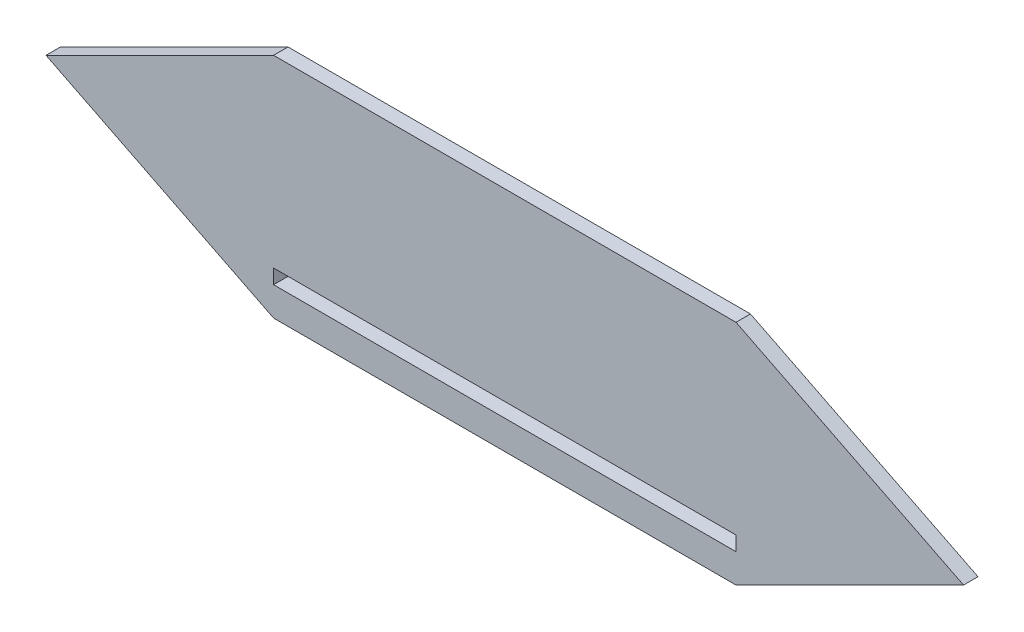
ISO-10303-21;
HEADER;
FILE_DESCRIPTION(('STEP AP214'),'2;1');
FILE_NAME('part.step','',(''),(''),'','','');
FILE_SCHEMA(('AUTOMOTIVE_DESIGN { 1 0 10303 214 1 1 1 1 }'));
ENDSEC;
DATA;
#1=APPLICATION_CONTEXT('core data for automotive mechanical design processes');
#2=APPLICATION_PROTOCOL_DEFINITION('international standard','automotive_design',2000,#1);
#3=PRODUCT_CONTEXT('',#1,'mechanical');
#4=PRODUCT('Part','Part','',(#3));
#5=PRODUCT_RELATED_PRODUCT_CATEGORY('part','',(#4));
#6=PRODUCT_DEFINITION_FORMATION('','',#4);
#7=PRODUCT_DEFINITION_CONTEXT('part definition',#1,'design');
#8=PRODUCT_DEFINITION('design','',#6,#7);
#9=PRODUCT_DEFINITION_SHAPE('','',#8);
#10=(LENGTH_UNIT() NAMED_UNIT(*) SI_UNIT(.MILLI.,.METRE.));
#11=(NAMED_UNIT(*) PLANE_ANGLE_UNIT() SI_UNIT($,.RADIAN.));
#12=(NAMED_UNIT(*) SI_UNIT($,.STERADIAN.) SOLID_ANGLE_UNIT());
#13=UNCERTAINTY_MEASURE_WITH_UNIT(LENGTH_MEASURE(1.E-05),#10,'distance_accuracy_value','');
#14=(GEOMETRIC_REPRESENTATION_CONTEXT(3) GLOBAL_UNCERTAINTY_ASSIGNED_CONTEXT((#13)) GLOBAL_UNIT_ASSIGNED_CONTEXT((#10,
#11,#12)) REPRESENTATION_CONTEXT('',''));
#15=CARTESIAN_POINT('',(0.,0.,0.));
#16=DIRECTION('',(0.,0.,1.));
#17=DIRECTION('',(1.,0.,0.));
#18=AXIS2_PLACEMENT_3D('',#15,#16,#17);
#19=CARTESIAN_POINT('',(0.,0.,0.));
#20=DIRECTION('',(0.,0.,1.));
#21=DIRECTION('',(1.,0.,0.));
#22=AXIS2_PLACEMENT_3D('',#19,#20,#21);
#23=PLANE('',#22);
#24=DIRECTION('',(-0.894427190999916,-0.447213595499958,0.));
#25=VECTOR('',#24,1.);
#26=CARTESIAN_POINT('',(-40.,80.,0.));
#27=LINE('',#26,#25);
#28=CARTESIAN_POINT('',(0.,100.,0.));
#29=VERTEX_POINT('',#28);
#30=CARTESIAN_POINT('',(-100.,50.,0.));
#31=VERTEX_POINT('',#30);
#32=EDGE_CURVE('E339',#29,#31,#27,.T.);
#33=ORIENTED_EDGE('',*,*,#32,.F.);
#34=DIRECTION('',(1.,0.,0.));
#35=VECTOR('',#34,1.);
#36=CARTESIAN_POINT('',(0.,100.,0.));
#37=LINE('',#36,#35);
#38=CARTESIAN_POINT('',(203.2,100.,0.));
#39=VERTEX_POINT('',#38);
#40=EDGE_CURVE('E344',#29,#39,#37,.T.);
#41=ORIENTED_EDGE('',*,*,#40,.T.);
#42=DIRECTION('',(0.894427190999916,-0.447213595499958,0.));
#43=VECTOR('',#42,1.);
#44=CARTESIAN_POINT('',(80.64,161.28,0.));
#45=LINE('',#44,#43);
#46=CARTESIAN_POINT('',(303.2,50.,0.));
#47=VERTEX_POINT('',#46);
#48=EDGE_CURVE('E368',#39,#47,#45,.T.);
#49=ORIENTED_EDGE('',*,*,#48,.T.);
#50=DIRECTION('',(-0.894427190999916,-0.447213595499958,0.));
#51=VECTOR('',#50,1.);
#52=CARTESIAN_POINT('',(40.64,-81.28,0.));
#53=LINE('',#52,#51);
#54=CARTESIAN_POINT('',(203.2,0.,0.));
#55=VERTEX_POINT('',#54);
#56=EDGE_CURVE('E365',#47,#55,#53,.T.);
#57=ORIENTED_EDGE('',*,*,#56,.T.);
#58=DIRECTION('',(1.,0.,0.));
#59=VECTOR('',#58,1.);
#60=CARTESIAN_POINT('',(0.,0.,0.));
#61=LINE('',#60,#59);
#62=CARTESIAN_POINT('',(0.,0.,0.));
#63=VERTEX_POINT('',#62);
#64=EDGE_CURVE('E362',#63,#55,#61,.T.);
#65=ORIENTED_EDGE('',*,*,#64,.F.);
#66=DIRECTION('',(0.894427190999916,-0.447213595499958,0.));
#67=VECTOR('',#66,1.);
#68=CARTESIAN_POINT('',(0.,0.,0.));
#69=LINE('',#68,#67);
#70=EDGE_CURVE('E360',#31,#63,#69,.T.);
#71=ORIENTED_EDGE('',*,*,#70,.F.);
#72=EDGE_LOOP('',(#33,#41,#49,#57,#65,#71));
#73=FACE_BOUND('',#72,.T.);
#74=DIRECTION('',(0.,1.,0.));
#75=VECTOR('',#74,1.);
#76=CARTESIAN_POINT('',(177.8,0.,0.));
#77=LINE('',#76,#75);
#78=CARTESIAN_POINT('',(177.8,19.05,0.));
#79=VERTEX_POINT('',#78);
#80=CARTESIAN_POINT('',(177.8,25.05,0.));
#81=VERTEX_POINT('',#80);
#82=EDGE_CURVE('E251',#79,#81,#77,.T.);
#83=ORIENTED_EDGE('',*,*,#82,.F.);
#84=DIRECTION('',(1.,0.,0.));
#85=VECTOR('',#84,1.);
#86=CARTESIAN_POINT('',(203.2,19.05,0.));
#87=LINE('',#86,#85);
#88=CARTESIAN_POINT('',(25.4,19.05,0.));
#89=VERTEX_POINT('',#88);
#90=EDGE_CURVE('E231',#89,#79,#87,.T.);
#91=ORIENTED_EDGE('',*,*,#90,.F.);
#92=DIRECTION('',(0.,1.,0.));
#93=VECTOR('',#92,1.);
#94=CARTESIAN_POINT('',(25.4,0.,0.));
#95=LINE('',#94,#93);
#96=CARTESIAN_POINT('',(25.4,25.05,0.));
#97=VERTEX_POINT('',#96);
#98=EDGE_CURVE('E296',#89,#97,#95,.T.);
#99=ORIENTED_EDGE('',*,*,#98,.T.);
#100=DIRECTION('',(1.,0.,0.));
#101=VECTOR('',#100,1.);
#102=CARTESIAN_POINT('',(0.,25.05,0.));
#103=LINE('',#102,#101);
#104=CARTESIAN_POINT('',(-6.00000000000001,25.05,0.));
#105=VERTEX_POINT('',#104);
#106=EDGE_CURVE('E91',#105,#97,#103,.T.);
#107=ORIENTED_EDGE('',*,*,#106,.F.);
#108=DIRECTION('',(0.,-1.,0.));
#109=VECTOR('',#108,1.);
#110=CARTESIAN_POINT('',(-6.00000000000001,0.,0.));
#111=LINE('',#110,#109);
#112=CARTESIAN_POINT('',(-6.00000000000001,6.69999999999998,0.));
#113=VERTEX_POINT('',#112);
#114=EDGE_CURVE('E318',#105,#113,#111,.T.);
#115=ORIENTED_EDGE('',*,*,#114,.T.);
#116=DIRECTION('',(-1.,0.,0.));
#117=VECTOR('',#116,1.);
#118=CARTESIAN_POINT('',(0.,6.69999999999998,0.));
#119=LINE('',#118,#117);
#120=CARTESIAN_POINT('',(25.4,6.69999999999998,0.));
#121=VERTEX_POINT('',#120);
#122=EDGE_CURVE('E315',#121,#113,#119,.T.);
#123=ORIENTED_EDGE('',*,*,#122,.F.);
#124=DIRECTION('',(0.,1.,0.));
#125=VECTOR('',#124,1.);
#126=CARTESIAN_POINT('',(25.4,0.,0.));
#127=LINE('',#126,#125);
#128=CARTESIAN_POINT('',(25.4,12.7,0.));
#129=VERTEX_POINT('',#128);
#130=EDGE_CURVE('E227',#121,#129,#127,.T.);
#131=ORIENTED_EDGE('',*,*,#130,.T.);
#132=DIRECTION('',(-1.,0.,0.));
#133=VECTOR('',#132,1.);
#134=CARTESIAN_POINT('',(203.2,12.7,0.));
#135=LINE('',#134,#133);
#136=CARTESIAN_POINT('',(177.8,12.7,0.));
#137=VERTEX_POINT('',#136);
#138=EDGE_CURVE('E220',#137,#129,#135,.T.);
#139=ORIENTED_EDGE('',*,*,#138,.F.);
#140=DIRECTION('',(0.,1.,0.));
#141=VECTOR('',#140,1.);
#142=CARTESIAN_POINT('',(177.8,6.69999999999998,0.));
#143=LINE('',#142,#141);
#144=CARTESIAN_POINT('',(177.8,6.69999999999998,0.));
#145=VERTEX_POINT('',#144);
#146=EDGE_CURVE('E224',#145,#137,#143,.T.);
#147=ORIENTED_EDGE('',*,*,#146,.F.);
#148=DIRECTION('',(-1.,0.,0.));
#149=VECTOR('',#148,1.);
#150=CARTESIAN_POINT('',(203.2,6.69999999999998,0.));
#151=LINE('',#150,#149);
#152=CARTESIAN_POINT('',(209.2,6.69999999999998,0.));
#153=VERTEX_POINT('',#152);
#154=EDGE_CURVE('E242',#153,#145,#151,.T.);
#155=ORIENTED_EDGE('',*,*,#154,.F.);
#156=DIRECTION('',(0.,-1.,0.));
#157=VECTOR('',#156,1.);
#158=CARTESIAN_POINT('',(209.2,0.,0.));
#159=LINE('',#158,#157);
#160=CARTESIAN_POINT('',(209.2,25.05,0.));
#161=VERTEX_POINT('',#160);
#162=EDGE_CURVE('E272',#161,#153,#159,.T.);
#163=ORIENTED_EDGE('',*,*,#162,.F.);
#164=DIRECTION('',(-1.,0.,0.));
#165=VECTOR('',#164,1.);
#166=CARTESIAN_POINT('',(0.,25.05,0.));
#167=LINE('',#166,#165);
#168=EDGE_CURVE('E275',#161,#81,#167,.T.);
#169=ORIENTED_EDGE('',*,*,#168,.T.);
#170=EDGE_LOOP('',(#83,#91,#99,#107,#115,#123,#131,#139,#147,#155,#163,#169));
#171=FACE_BOUND('',#170,.T.);
#172=ADVANCED_FACE('F68',(#73,#171),#23,.F.);
#173=CARTESIAN_POINT('',(-40.,80.,6.35));
#174=DIRECTION('',(0.447213595499958,-0.894427190999916,0.));
#175=DIRECTION('',(0.894427190999916,0.447213595499958,0.));
#176=AXIS2_PLACEMENT_3D('',#173,#174,#175);
#177=PLANE('',#176);
#178=ORIENTED_EDGE('',*,*,#32,.T.);
#179=DIRECTION('',(0.,0.,-1.));
#180=VECTOR('',#179,1.);
#181=CARTESIAN_POINT('',(-100.,50.,6.35));
#182=LINE('',#181,#180);
#183=CARTESIAN_POINT('',(-100.,50.,6.35));
#184=VERTEX_POINT('',#183);
#185=EDGE_CURVE('E383',#184,#31,#182,.T.);
#186=ORIENTED_EDGE('',*,*,#185,.F.);
#187=DIRECTION('',(-0.894427190999916,-0.447213595499958,0.));
#188=VECTOR('',#187,1.);
#189=CARTESIAN_POINT('',(-40.,80.,6.35));
#190=LINE('',#189,#188);
#191=CARTESIAN_POINT('',(0.,100.,6.35));
#192=VERTEX_POINT('',#191);
#193=EDGE_CURVE('E340',#192,#184,#190,.T.);
#194=ORIENTED_EDGE('',*,*,#193,.F.);
#195=DIRECTION('',(0.,0.,-1.));
#196=VECTOR('',#195,1.);
#197=CARTESIAN_POINT('',(0.,100.,6.35));
#198=LINE('',#197,#196);
#199=EDGE_CURVE('E357',#192,#29,#198,.T.);
#200=ORIENTED_EDGE('',*,*,#199,.T.);
#201=EDGE_LOOP('',(#178,#186,#194,#200));
#202=FACE_BOUND('',#201,.T.);
#203=ADVANCED_FACE('F70',(#202),#177,.F.);
#204=CARTESIAN_POINT('',(0.,0.,6.35));
#205=DIRECTION('',(0.447213595499958,0.894427190999916,0.));
#206=DIRECTION('',(-0.894427190999916,0.447213595499958,0.));
#207=AXIS2_PLACEMENT_3D('',#204,#205,#206);
#208=PLANE('',#207);
#209=ORIENTED_EDGE('',*,*,#70,.T.);
#210=DIRECTION('',(0.,0.,-1.));
#211=VECTOR('',#210,1.);
#212=CARTESIAN_POINT('',(0.,0.,6.35));
#213=LINE('',#212,#211);
#214=CARTESIAN_POINT('',(0.,0.,6.35));
#215=VERTEX_POINT('',#214);
#216=EDGE_CURVE('E380',#215,#63,#213,.T.);
#217=ORIENTED_EDGE('',*,*,#216,.F.);
#218=DIRECTION('',(0.894427190999916,-0.447213595499958,0.));
#219=VECTOR('',#218,1.);
#220=CARTESIAN_POINT('',(0.,0.,6.35));
#221=LINE('',#220,#219);
#222=EDGE_CURVE('E343',#184,#215,#221,.T.);
#223=ORIENTED_EDGE('',*,*,#222,.F.);
#224=ORIENTED_EDGE('',*,*,#185,.T.);
#225=EDGE_LOOP('',(#209,#217,#223,#224));
#226=FACE_BOUND('',#225,.T.);
#227=ADVANCED_FACE('F440',(#226),#208,.F.);
#228=CARTESIAN_POINT('',(0.,0.,6.35));
#229=DIRECTION('',(0.,1.,0.));
#230=DIRECTION('',(0.,0.,1.));
#231=AXIS2_PLACEMENT_3D('',#228,#229,#230);
#232=PLANE('',#231);
#233=ORIENTED_EDGE('',*,*,#64,.T.);
#234=DIRECTION('',(0.,0.,-1.));
#235=VECTOR('',#234,1.);
#236=CARTESIAN_POINT('',(203.2,0.,6.35));
#237=LINE('',#236,#235);
#238=CARTESIAN_POINT('',(203.2,0.,6.35));
#239=VERTEX_POINT('',#238);
#240=EDGE_CURVE('E378',#239,#55,#237,.T.);
#241=ORIENTED_EDGE('',*,*,#240,.F.);
#242=DIRECTION('',(1.,0.,0.));
#243=VECTOR('',#242,1.);
#244=CARTESIAN_POINT('',(0.,0.,6.35));
#245=LINE('',#244,#243);
#246=EDGE_CURVE('E346',#215,#239,#245,.T.);
#247=ORIENTED_EDGE('',*,*,#246,.F.);
#248=ORIENTED_EDGE('',*,*,#216,.T.);
#249=EDGE_LOOP('',(#233,#241,#247,#248));
#250=FACE_BOUND('',#249,.T.);
#251=ADVANCED_FACE('F457',(#250),#232,.F.);
#252=CARTESIAN_POINT('',(40.64,-81.28,6.35));
#253=DIRECTION('',(0.447213595499958,-0.894427190999916,0.));
#254=DIRECTION('',(0.894427190999916,0.447213595499958,0.));
#255=AXIS2_PLACEMENT_3D('',#252,#253,#254);
#256=PLANE('',#255);
#257=ORIENTED_EDGE('',*,*,#56,.F.);
#258=DIRECTION('',(0.,0.,-1.));
#259=VECTOR('',#258,1.);
#260=CARTESIAN_POINT('',(303.2,50.,6.35));
#261=LINE('',#260,#259);
#262=CARTESIAN_POINT('',(303.2,50.,6.35));
#263=VERTEX_POINT('',#262);
#264=EDGE_CURVE('E376',#263,#47,#261,.T.);
#265=ORIENTED_EDGE('',*,*,#264,.F.);
#266=DIRECTION('',(-0.894427190999916,-0.447213595499958,0.));
#267=VECTOR('',#266,1.);
#268=CARTESIAN_POINT('',(40.64,-81.28,6.35));
#269=LINE('',#268,#267);
#270=EDGE_CURVE('E348',#263,#239,#269,.T.);
#271=ORIENTED_EDGE('',*,*,#270,.T.);
#272=ORIENTED_EDGE('',*,*,#240,.T.);
#273=EDGE_LOOP('',(#257,#265,#271,#272));
#274=FACE_BOUND('',#273,.T.);
#275=ADVANCED_FACE('F453',(#274),#256,.T.);
#276=CARTESIAN_POINT('',(80.64,161.28,6.35));
#277=DIRECTION('',(0.447213595499958,0.894427190999916,0.));
#278=DIRECTION('',(-0.894427190999916,0.447213595499958,0.));
#279=AXIS2_PLACEMENT_3D('',#276,#277,#278);
#280=PLANE('',#279);
#281=ORIENTED_EDGE('',*,*,#48,.F.);
#282=DIRECTION('',(0.,0.,-1.));
#283=VECTOR('',#282,1.);
#284=CARTESIAN_POINT('',(203.2,100.,6.35));
#285=LINE('',#284,#283);
#286=CARTESIAN_POINT('',(203.2,100.,6.35));
#287=VERTEX_POINT('',#286);
#288=EDGE_CURVE('E374',#287,#39,#285,.T.);
#289=ORIENTED_EDGE('',*,*,#288,.F.);
#290=DIRECTION('',(0.894427190999916,-0.447213595499958,0.));
#291=VECTOR('',#290,1.);
#292=CARTESIAN_POINT('',(80.64,161.28,6.35));
#293=LINE('',#292,#291);
#294=EDGE_CURVE('E351',#287,#263,#293,.T.);
#295=ORIENTED_EDGE('',*,*,#294,.T.);
#296=ORIENTED_EDGE('',*,*,#264,.T.);
#297=EDGE_LOOP('',(#281,#289,#295,#296));
#298=FACE_BOUND('',#297,.T.);
#299=ADVANCED_FACE('F449',(#298),#280,.T.);
#300=CARTESIAN_POINT('',(0.,100.,6.35));
#301=DIRECTION('',(0.,1.,0.));
#302=DIRECTION('',(0.,0.,1.));
#303=AXIS2_PLACEMENT_3D('',#300,#301,#302);
#304=PLANE('',#303);
#305=ORIENTED_EDGE('',*,*,#40,.F.);
#306=ORIENTED_EDGE('',*,*,#199,.F.);
#307=DIRECTION('',(1.,0.,0.));
#308=VECTOR('',#307,1.);
#309=CARTESIAN_POINT('',(0.,100.,6.35));
#310=LINE('',#309,#308);
#311=EDGE_CURVE('E354',#192,#287,#310,.T.);
#312=ORIENTED_EDGE('',*,*,#311,.T.);
#313=ORIENTED_EDGE('',*,*,#288,.T.);
#314=EDGE_LOOP('',(#305,#306,#312,#313));
#315=FACE_BOUND('',#314,.T.);
#316=ADVANCED_FACE('F446',(#315),#304,.T.);
#317=CARTESIAN_POINT('',(0.,0.,6.35));
#318=DIRECTION('',(0.,0.,1.));
#319=DIRECTION('',(1.,0.,0.));
#320=AXIS2_PLACEMENT_3D('',#317,#318,#319);
#321=PLANE('',#320);
#322=DIRECTION('',(0.,1.,0.));
#323=VECTOR('',#322,1.);
#324=CARTESIAN_POINT('',(203.2,0.,6.35));
#325=LINE('',#324,#323);
#326=CARTESIAN_POINT('',(203.2,12.7,6.35));
#327=VERTEX_POINT('',#326);
#328=CARTESIAN_POINT('',(203.2,19.05,6.35));
#329=VERTEX_POINT('',#328);
#330=EDGE_CURVE('E12',#327,#329,#325,.T.);
#331=ORIENTED_EDGE('',*,*,#330,.F.);
#332=DIRECTION('',(1.,0.,0.));
#333=VECTOR('',#332,1.);
#334=CARTESIAN_POINT('',(0.,12.7,6.35));
#335=LINE('',#334,#333);
#336=CARTESIAN_POINT('',(0.,12.7,6.35));
#337=VERTEX_POINT('',#336);
#338=EDGE_CURVE('E386',#337,#327,#335,.T.);
#339=ORIENTED_EDGE('',*,*,#338,.F.);
#340=DIRECTION('',(0.,-1.,0.));
#341=VECTOR('',#340,1.);
#342=CARTESIAN_POINT('',(0.,0.,6.35));
#343=LINE('',#342,#341);
#344=CARTESIAN_POINT('',(0.,19.05,6.35));
#345=VERTEX_POINT('',#344);
#346=EDGE_CURVE('E388',#345,#337,#343,.T.);
#347=ORIENTED_EDGE('',*,*,#346,.F.);
#348=DIRECTION('',(-1.,0.,0.));
#349=VECTOR('',#348,1.);
#350=CARTESIAN_POINT('',(0.,19.05,6.35));
#351=LINE('',#350,#349);
#352=EDGE_CURVE('E76',#329,#345,#351,.T.);
#353=ORIENTED_EDGE('',*,*,#352,.F.);
#354=EDGE_LOOP('',(#331,#339,#347,#353));
#355=FACE_BOUND('',#354,.T.);
#356=ORIENTED_EDGE('',*,*,#193,.T.);
#357=ORIENTED_EDGE('',*,*,#222,.T.);
#358=ORIENTED_EDGE('',*,*,#246,.T.);
#359=ORIENTED_EDGE('',*,*,#270,.F.);
#360=ORIENTED_EDGE('',*,*,#294,.F.);
#361=ORIENTED_EDGE('',*,*,#311,.F.);
#362=EDGE_LOOP('',(#356,#357,#358,#359,#360,#361));
#363=FACE_BOUND('',#362,.T.);
#364=ADVANCED_FACE('F400',(#355,#363),#321,.T.);
#365=CARTESIAN_POINT('',(0.,19.05,-25.));
#366=DIRECTION('',(0.,-1.,0.));
#367=DIRECTION('',(0.,0.,-1.));
#368=AXIS2_PLACEMENT_3D('',#365,#366,#367);
#369=PLANE('',#368);
#370=DIRECTION('',(0.,0.,1.));
#371=VECTOR('',#370,1.);
#372=CARTESIAN_POINT('',(25.4,19.05,-25.));
#373=LINE('',#372,#371);
#374=CARTESIAN_POINT('',(25.4,19.05,-25.));
#375=VERTEX_POINT('',#374);
#376=EDGE_CURVE('E313',#375,#89,#373,.T.);
#377=ORIENTED_EDGE('',*,*,#376,.T.);
#378=ORIENTED_EDGE('',*,*,#90,.T.);
#379=DIRECTION('',(0.,0.,1.));
#380=VECTOR('',#379,1.);
#381=CARTESIAN_POINT('',(177.8,19.05,-25.));
#382=LINE('',#381,#380);
#383=CARTESIAN_POINT('',(177.8,19.05,-25.));
#384=VERTEX_POINT('',#383);
#385=EDGE_CURVE('E257',#384,#79,#382,.T.);
#386=ORIENTED_EDGE('',*,*,#385,.F.);
#387=DIRECTION('',(-1.,0.,0.));
#388=VECTOR('',#387,1.);
#389=CARTESIAN_POINT('',(0.,19.05,-25.));
#390=LINE('',#389,#388);
#391=CARTESIAN_POINT('',(203.2,19.05,-25.));
#392=VERTEX_POINT('',#391);
#393=EDGE_CURVE('E276',#392,#384,#390,.T.);
#394=ORIENTED_EDGE('',*,*,#393,.F.);
#395=DIRECTION('',(0.,0.,1.));
#396=VECTOR('',#395,1.);
#397=CARTESIAN_POINT('',(203.2,19.05,-25.));
#398=LINE('',#397,#396);
#399=EDGE_CURVE('E269',#392,#329,#398,.T.);
#400=ORIENTED_EDGE('',*,*,#399,.T.);
#401=ORIENTED_EDGE('',*,*,#352,.T.);
#402=DIRECTION('',(0.,0.,1.));
#403=VECTOR('',#402,1.);
#404=CARTESIAN_POINT('',(0.,19.05,-25.));
#405=LINE('',#404,#403);
#406=CARTESIAN_POINT('',(0.,19.05,-25.));
#407=VERTEX_POINT('',#406);
#408=EDGE_CURVE('E337',#407,#345,#405,.T.);
#409=ORIENTED_EDGE('',*,*,#408,.F.);
#410=DIRECTION('',(1.,0.,0.));
#411=VECTOR('',#410,1.);
#412=CARTESIAN_POINT('',(0.,19.05,-25.));
#413=LINE('',#412,#411);
#414=EDGE_CURVE('E292',#407,#375,#413,.T.);
#415=ORIENTED_EDGE('',*,*,#414,.T.);
#416=EDGE_LOOP('',(#377,#378,#386,#394,#400,#401,#409,#415));
#417=FACE_BOUND('',#416,.T.);
#418=ADVANCED_FACE('F393',(#417),#369,.T.);
#419=CARTESIAN_POINT('',(0.,0.,-25.));
#420=DIRECTION('',(-1.,0.,0.));
#421=DIRECTION('',(0.,0.,1.));
#422=AXIS2_PLACEMENT_3D('',#419,#420,#421);
#423=PLANE('',#422);
#424=ORIENTED_EDGE('',*,*,#408,.T.);
#425=ORIENTED_EDGE('',*,*,#346,.T.);
#426=DIRECTION('',(0.,0.,1.));
#427=VECTOR('',#426,1.);
#428=CARTESIAN_POINT('',(0.,12.7,-25.));
#429=LINE('',#428,#427);
#430=CARTESIAN_POINT('',(0.,12.7,-25.));
#431=VERTEX_POINT('',#430);
#432=EDGE_CURVE('E83',#431,#337,#429,.T.);
#433=ORIENTED_EDGE('',*,*,#432,.F.);
#434=DIRECTION('',(0.,-1.,0.));
#435=VECTOR('',#434,1.);
#436=CARTESIAN_POINT('',(0.,0.,-25.));
#437=LINE('',#436,#435);
#438=EDGE_CURVE('E295',#407,#431,#437,.T.);
#439=ORIENTED_EDGE('',*,*,#438,.F.);
#440=EDGE_LOOP('',(#424,#425,#433,#439));
#441=FACE_BOUND('',#440,.T.);
#442=ADVANCED_FACE('F403',(#441),#423,.F.);
#443=CARTESIAN_POINT('',(0.,12.7,-25.));
#444=DIRECTION('',(0.,-1.,0.));
#445=DIRECTION('',(0.,0.,-1.));
#446=AXIS2_PLACEMENT_3D('',#443,#444,#445);
#447=PLANE('',#446);
#448=ORIENTED_EDGE('',*,*,#432,.T.);
#449=ORIENTED_EDGE('',*,*,#338,.T.);
#450=DIRECTION('',(0.,0.,1.));
#451=VECTOR('',#450,1.);
#452=CARTESIAN_POINT('',(203.2,12.7,-25.));
#453=LINE('',#452,#451);
#454=CARTESIAN_POINT('',(203.2,12.7,-25.));
#455=VERTEX_POINT('',#454);
#456=EDGE_CURVE('E255',#455,#327,#453,.T.);
#457=ORIENTED_EDGE('',*,*,#456,.F.);
#458=DIRECTION('',(-1.,0.,0.));
#459=VECTOR('',#458,1.);
#460=CARTESIAN_POINT('',(203.2,12.7,-25.));
#461=LINE('',#460,#459);
#462=CARTESIAN_POINT('',(177.8,12.7,-25.));
#463=VERTEX_POINT('',#462);
#464=EDGE_CURVE('E246',#455,#463,#461,.T.);
#465=ORIENTED_EDGE('',*,*,#464,.T.);
#466=DIRECTION('',(0.,0.,1.));
#467=VECTOR('',#466,1.);
#468=CARTESIAN_POINT('',(177.8,12.7,-25.));
#469=LINE('',#468,#467);
#470=EDGE_CURVE('E238',#463,#137,#469,.T.);
#471=ORIENTED_EDGE('',*,*,#470,.T.);
#472=ORIENTED_EDGE('',*,*,#138,.T.);
#473=DIRECTION('',(0.,0.,1.));
#474=VECTOR('',#473,1.);
#475=CARTESIAN_POINT('',(25.4,12.7,-25.));
#476=LINE('',#475,#474);
#477=CARTESIAN_POINT('',(25.4,12.7,-25.));
#478=VERTEX_POINT('',#477);
#479=EDGE_CURVE('E334',#478,#129,#476,.T.);
#480=ORIENTED_EDGE('',*,*,#479,.F.);
#481=DIRECTION('',(1.,0.,0.));
#482=VECTOR('',#481,1.);
#483=CARTESIAN_POINT('',(0.,12.7,-25.));
#484=LINE('',#483,#482);
#485=EDGE_CURVE('E298',#431,#478,#484,.T.);
#486=ORIENTED_EDGE('',*,*,#485,.F.);
#487=EDGE_LOOP('',(#448,#449,#457,#465,#471,#472,#480,#486));
#488=FACE_BOUND('',#487,.T.);
#489=ADVANCED_FACE('F244',(#488),#447,.F.);
#490=CARTESIAN_POINT('',(25.4,0.,-25.));
#491=DIRECTION('',(1.,0.,0.));
#492=DIRECTION('',(0.,0.,-1.));
#493=AXIS2_PLACEMENT_3D('',#490,#491,#492);
#494=PLANE('',#493);
#495=ORIENTED_EDGE('',*,*,#130,.F.);
#496=DIRECTION('',(0.,0.,1.));
#497=VECTOR('',#496,1.);
#498=CARTESIAN_POINT('',(25.4,6.69999999999998,-25.));
#499=LINE('',#498,#497);
#500=CARTESIAN_POINT('',(25.4,6.69999999999998,-25.));
#501=VERTEX_POINT('',#500);
#502=EDGE_CURVE('E332',#501,#121,#499,.T.);
#503=ORIENTED_EDGE('',*,*,#502,.F.);
#504=DIRECTION('',(0.,1.,0.));
#505=VECTOR('',#504,1.);
#506=CARTESIAN_POINT('',(25.4,0.,-25.));
#507=LINE('',#506,#505);
#508=EDGE_CURVE('E300',#501,#478,#507,.T.);
#509=ORIENTED_EDGE('',*,*,#508,.T.);
#510=ORIENTED_EDGE('',*,*,#479,.T.);
#511=EDGE_LOOP('',(#495,#503,#509,#510));
#512=FACE_BOUND('',#511,.T.);
#513=ADVANCED_FACE('F488',(#512),#494,.T.);
#514=CARTESIAN_POINT('',(0.,6.69999999999998,-25.));
#515=DIRECTION('',(0.,1.,0.));
#516=DIRECTION('',(0.,0.,1.));
#517=AXIS2_PLACEMENT_3D('',#514,#515,#516);
#518=PLANE('',#517);
#519=ORIENTED_EDGE('',*,*,#122,.T.);
#520=DIRECTION('',(0.,0.,1.));
#521=VECTOR('',#520,1.);
#522=CARTESIAN_POINT('',(-6.00000000000001,6.69999999999998,-25.));
#523=LINE('',#522,#521);
#524=CARTESIAN_POINT('',(-6.00000000000001,6.69999999999998,-25.));
#525=VERTEX_POINT('',#524);
#526=EDGE_CURVE('E330',#525,#113,#523,.T.);
#527=ORIENTED_EDGE('',*,*,#526,.F.);
#528=DIRECTION('',(-1.,0.,0.));
#529=VECTOR('',#528,1.);
#530=CARTESIAN_POINT('',(0.,6.69999999999998,-25.));
#531=LINE('',#530,#529);
#532=EDGE_CURVE('E303',#501,#525,#531,.T.);
#533=ORIENTED_EDGE('',*,*,#532,.F.);
#534=ORIENTED_EDGE('',*,*,#502,.T.);
#535=EDGE_LOOP('',(#519,#527,#533,#534));
#536=FACE_BOUND('',#535,.T.);
#537=ADVANCED_FACE('F491',(#536),#518,.F.);
#538=CARTESIAN_POINT('',(-6.00000000000001,0.,-25.));
#539=DIRECTION('',(-1.,0.,0.));
#540=DIRECTION('',(0.,0.,1.));
#541=AXIS2_PLACEMENT_3D('',#538,#539,#540);
#542=PLANE('',#541);
#543=ORIENTED_EDGE('',*,*,#114,.F.);
#544=DIRECTION('',(0.,0.,1.));
#545=VECTOR('',#544,1.);
#546=CARTESIAN_POINT('',(-6.00000000000001,25.05,-25.));
#547=LINE('',#546,#545);
#548=CARTESIAN_POINT('',(-6.00000000000001,25.05,-25.));
#549=VERTEX_POINT('',#548);
#550=EDGE_CURVE('E328',#549,#105,#547,.T.);
#551=ORIENTED_EDGE('',*,*,#550,.F.);
#552=DIRECTION('',(0.,-1.,0.));
#553=VECTOR('',#552,1.);
#554=CARTESIAN_POINT('',(-6.00000000000001,0.,-25.));
#555=LINE('',#554,#553);
#556=EDGE_CURVE('E305',#549,#525,#555,.T.);
#557=ORIENTED_EDGE('',*,*,#556,.T.);
#558=ORIENTED_EDGE('',*,*,#526,.T.);
#559=EDGE_LOOP('',(#543,#551,#557,#558));
#560=FACE_BOUND('',#559,.T.);
#561=ADVANCED_FACE('F495',(#560),#542,.T.);
#562=CARTESIAN_POINT('',(0.,25.05,-25.));
#563=DIRECTION('',(0.,-1.,0.));
#564=DIRECTION('',(0.,0.,-1.));
#565=AXIS2_PLACEMENT_3D('',#562,#563,#564);
#566=PLANE('',#565);
#567=ORIENTED_EDGE('',*,*,#106,.T.);
#568=DIRECTION('',(0.,0.,1.));
#569=VECTOR('',#568,1.);
#570=CARTESIAN_POINT('',(25.4,25.05,-25.));
#571=LINE('',#570,#569);
#572=CARTESIAN_POINT('',(25.4,25.05,-25.));
#573=VERTEX_POINT('',#572);
#574=EDGE_CURVE('E326',#573,#97,#571,.T.);
#575=ORIENTED_EDGE('',*,*,#574,.F.);
#576=DIRECTION('',(1.,0.,0.));
#577=VECTOR('',#576,1.);
#578=CARTESIAN_POINT('',(0.,25.05,-25.));
#579=LINE('',#578,#577);
#580=EDGE_CURVE('E308',#549,#573,#579,.T.);
#581=ORIENTED_EDGE('',*,*,#580,.F.);
#582=ORIENTED_EDGE('',*,*,#550,.T.);
#583=EDGE_LOOP('',(#567,#575,#581,#582));
#584=FACE_BOUND('',#583,.T.);
#585=ADVANCED_FACE('F499',(#584),#566,.F.);
#586=CARTESIAN_POINT('',(25.4,0.,-25.));
#587=DIRECTION('',(1.,0.,0.));
#588=DIRECTION('',(0.,0.,-1.));
#589=AXIS2_PLACEMENT_3D('',#586,#587,#588);
#590=PLANE('',#589);
#591=ORIENTED_EDGE('',*,*,#98,.F.);
#592=ORIENTED_EDGE('',*,*,#376,.F.);
#593=DIRECTION('',(0.,1.,0.));
#594=VECTOR('',#593,1.);
#595=CARTESIAN_POINT('',(25.4,0.,-25.));
#596=LINE('',#595,#594);
#597=EDGE_CURVE('E310',#375,#573,#596,.T.);
#598=ORIENTED_EDGE('',*,*,#597,.T.);
#599=ORIENTED_EDGE('',*,*,#574,.T.);
#600=EDGE_LOOP('',(#591,#592,#598,#599));
#601=FACE_BOUND('',#600,.T.);
#602=ADVANCED_FACE('F411',(#601),#590,.T.);
#603=CARTESIAN_POINT('',(0.,0.,-25.));
#604=DIRECTION('',(0.,0.,-1.));
#605=DIRECTION('',(-1.,0.,0.));
#606=AXIS2_PLACEMENT_3D('',#603,#604,#605);
#607=PLANE('',#606);
#608=ORIENTED_EDGE('',*,*,#414,.F.);
#609=ORIENTED_EDGE('',*,*,#438,.T.);
#610=ORIENTED_EDGE('',*,*,#485,.T.);
#611=ORIENTED_EDGE('',*,*,#508,.F.);
#612=ORIENTED_EDGE('',*,*,#532,.T.);
#613=ORIENTED_EDGE('',*,*,#556,.F.);
#614=ORIENTED_EDGE('',*,*,#580,.T.);
#615=ORIENTED_EDGE('',*,*,#597,.F.);
#616=EDGE_LOOP('',(#608,#609,#610,#611,#612,#613,#614,#615));
#617=FACE_BOUND('',#616,.T.);
#618=ADVANCED_FACE('F407',(#617),#607,.T.);
#619=CARTESIAN_POINT('',(177.8,0.,-25.));
#620=DIRECTION('',(1.,0.,0.));
#621=DIRECTION('',(0.,0.,-1.));
#622=AXIS2_PLACEMENT_3D('',#619,#620,#621);
#623=PLANE('',#622);
#624=ORIENTED_EDGE('',*,*,#82,.T.);
#625=DIRECTION('',(0.,0.,1.));
#626=VECTOR('',#625,1.);
#627=CARTESIAN_POINT('',(177.8,25.05,-25.));
#628=LINE('',#627,#626);
#629=CARTESIAN_POINT('',(177.8,25.05,-25.));
#630=VERTEX_POINT('',#629);
#631=EDGE_CURVE('E263',#630,#81,#628,.T.);
#632=ORIENTED_EDGE('',*,*,#631,.F.);
#633=DIRECTION('',(0.,1.,0.));
#634=VECTOR('',#633,1.);
#635=CARTESIAN_POINT('',(177.8,0.,-25.));
#636=LINE('',#635,#634);
#637=EDGE_CURVE('E288',#384,#630,#636,.T.);
#638=ORIENTED_EDGE('',*,*,#637,.F.);
#639=ORIENTED_EDGE('',*,*,#385,.T.);
#640=EDGE_LOOP('',(#624,#632,#638,#639));
#641=FACE_BOUND('',#640,.T.);
#642=ADVANCED_FACE('F416',(#641),#623,.F.);
#643=CARTESIAN_POINT('',(0.,25.05,-25.));
#644=DIRECTION('',(0.,1.,0.));
#645=DIRECTION('',(0.,0.,1.));
#646=AXIS2_PLACEMENT_3D('',#643,#644,#645);
#647=PLANE('',#646);
#648=ORIENTED_EDGE('',*,*,#168,.F.);
#649=DIRECTION('',(0.,0.,1.));
#650=VECTOR('',#649,1.);
#651=CARTESIAN_POINT('',(209.2,25.05,-25.));
#652=LINE('',#651,#650);
#653=CARTESIAN_POINT('',(209.2,25.05,-25.));
#654=VERTEX_POINT('',#653);
#655=EDGE_CURVE('E265',#654,#161,#652,.T.);
#656=ORIENTED_EDGE('',*,*,#655,.F.);
#657=DIRECTION('',(-1.,0.,0.));
#658=VECTOR('',#657,1.);
#659=CARTESIAN_POINT('',(0.,25.05,-25.));
#660=LINE('',#659,#658);
#661=EDGE_CURVE('E285',#654,#630,#660,.T.);
#662=ORIENTED_EDGE('',*,*,#661,.T.);
#663=ORIENTED_EDGE('',*,*,#631,.T.);
#664=EDGE_LOOP('',(#648,#656,#662,#663));
#665=FACE_BOUND('',#664,.T.);
#666=ADVANCED_FACE('F509',(#665),#647,.T.);
#667=CARTESIAN_POINT('',(209.2,0.,-25.));
#668=DIRECTION('',(-1.,0.,0.));
#669=DIRECTION('',(0.,0.,1.));
#670=AXIS2_PLACEMENT_3D('',#667,#668,#669);
#671=PLANE('',#670);
#672=ORIENTED_EDGE('',*,*,#162,.T.);
#673=DIRECTION('',(0.,0.,1.));
#674=VECTOR('',#673,1.);
#675=CARTESIAN_POINT('',(209.2,6.69999999999998,-25.));
#676=LINE('',#675,#674);
#677=CARTESIAN_POINT('',(209.2,6.69999999999998,-25.));
#678=VERTEX_POINT('',#677);
#679=EDGE_CURVE('E267',#678,#153,#676,.T.);
#680=ORIENTED_EDGE('',*,*,#679,.F.);
#681=DIRECTION('',(0.,-1.,0.));
#682=VECTOR('',#681,1.);
#683=CARTESIAN_POINT('',(209.2,0.,-25.));
#684=LINE('',#683,#682);
#685=EDGE_CURVE('E282',#654,#678,#684,.T.);
#686=ORIENTED_EDGE('',*,*,#685,.F.);
#687=ORIENTED_EDGE('',*,*,#655,.T.);
#688=EDGE_LOOP('',(#672,#680,#686,#687));
#689=FACE_BOUND('',#688,.T.);
#690=ADVANCED_FACE('F431',(#689),#671,.F.);
#691=CARTESIAN_POINT('',(0.,6.69999999999998,-25.));
#692=DIRECTION('',(0.,-1.,0.));
#693=DIRECTION('',(0.,0.,-1.));
#694=AXIS2_PLACEMENT_3D('',#691,#692,#693);
#695=PLANE('',#694);
#696=ORIENTED_EDGE('',*,*,#679,.T.);
#697=ORIENTED_EDGE('',*,*,#154,.T.);
#698=DIRECTION('',(0.,0.,1.));
#699=VECTOR('',#698,1.);
#700=CARTESIAN_POINT('',(177.8,6.69999999999998,-25.));
#701=LINE('',#700,#699);
#702=CARTESIAN_POINT('',(177.8,6.69999999999998,-25.));
#703=VERTEX_POINT('',#702);
#704=EDGE_CURVE('E241',#703,#145,#701,.T.);
#705=ORIENTED_EDGE('',*,*,#704,.F.);
#706=DIRECTION('',(-1.,0.,0.));
#707=VECTOR('',#706,1.);
#708=CARTESIAN_POINT('',(203.2,6.69999999999998,-25.));
#709=LINE('',#708,#707);
#710=EDGE_CURVE('E247',#678,#703,#709,.T.);
#711=ORIENTED_EDGE('',*,*,#710,.F.);
#712=EDGE_LOOP('',(#696,#697,#705,#711));
#713=FACE_BOUND('',#712,.T.);
#714=ADVANCED_FACE('F424',(#713),#695,.T.);
#715=CARTESIAN_POINT('',(203.2,0.,-25.));
#716=DIRECTION('',(1.,0.,0.));
#717=DIRECTION('',(0.,0.,-1.));
#718=AXIS2_PLACEMENT_3D('',#715,#716,#717);
#719=PLANE('',#718);
#720=DIRECTION('',(0.,1.,0.));
#721=VECTOR('',#720,1.);
#722=CARTESIAN_POINT('',(203.2,0.,-25.));
#723=LINE('',#722,#721);
#724=EDGE_CURVE('E271',#455,#392,#723,.T.);
#725=ORIENTED_EDGE('',*,*,#724,.F.);
#726=ORIENTED_EDGE('',*,*,#456,.T.);
#727=ORIENTED_EDGE('',*,*,#330,.T.);
#728=ORIENTED_EDGE('',*,*,#399,.F.);
#729=EDGE_LOOP('',(#725,#726,#727,#728));
#730=FACE_BOUND('',#729,.T.);
#731=ADVANCED_FACE('F422',(#730),#719,.F.);
#732=CARTESIAN_POINT('',(0.,0.,-25.));
#733=DIRECTION('',(0.,0.,-1.));
#734=DIRECTION('',(-1.,0.,0.));
#735=AXIS2_PLACEMENT_3D('',#732,#733,#734);
#736=PLANE('',#735);
#737=ORIENTED_EDGE('',*,*,#393,.T.);
#738=ORIENTED_EDGE('',*,*,#637,.T.);
#739=ORIENTED_EDGE('',*,*,#661,.F.);
#740=ORIENTED_EDGE('',*,*,#685,.T.);
#741=ORIENTED_EDGE('',*,*,#710,.T.);
#742=DIRECTION('',(0.,1.,0.));
#743=VECTOR('',#742,1.);
#744=CARTESIAN_POINT('',(177.8,6.69999999999998,-25.));
#745=LINE('',#744,#743);
#746=EDGE_CURVE('E249',#703,#463,#745,.T.);
#747=ORIENTED_EDGE('',*,*,#746,.T.);
#748=ORIENTED_EDGE('',*,*,#464,.F.);
#749=ORIENTED_EDGE('',*,*,#724,.T.);
#750=EDGE_LOOP('',(#737,#738,#739,#740,#741,#747,#748,#749));
#751=FACE_BOUND('',#750,.T.);
#752=ADVANCED_FACE('F418',(#751),#736,.T.);
#753=CARTESIAN_POINT('',(177.8,6.69999999999998,-25.));
#754=DIRECTION('',(1.,0.,0.));
#755=DIRECTION('',(0.,0.,-1.));
#756=AXIS2_PLACEMENT_3D('',#753,#754,#755);
#757=PLANE('',#756);
#758=ORIENTED_EDGE('',*,*,#146,.T.);
#759=ORIENTED_EDGE('',*,*,#470,.F.);
#760=ORIENTED_EDGE('',*,*,#746,.F.);
#761=ORIENTED_EDGE('',*,*,#704,.T.);
#762=EDGE_LOOP('',(#758,#759,#760,#761));
#763=FACE_BOUND('',#762,.T.);
#764=ADVANCED_FACE('F236',(#763),#757,.F.);
#765=CLOSED_SHELL('',(#172,#203,#227,#251,#275,#299,#316,#364,#418,#442,#489,#513,#537,#561,
#585,#602,#618,#642,#666,#690,#714,#731,#752,#764));
#766=MANIFOLD_SOLID_BREP('B2',#765);
#767=ADVANCED_BREP_SHAPE_REPRESENTATION('',(#18,#766),#14);
#768=SHAPE_DEFINITION_REPRESENTATION(#9,#767);
ENDSEC;
END-ISO-10303-21;
